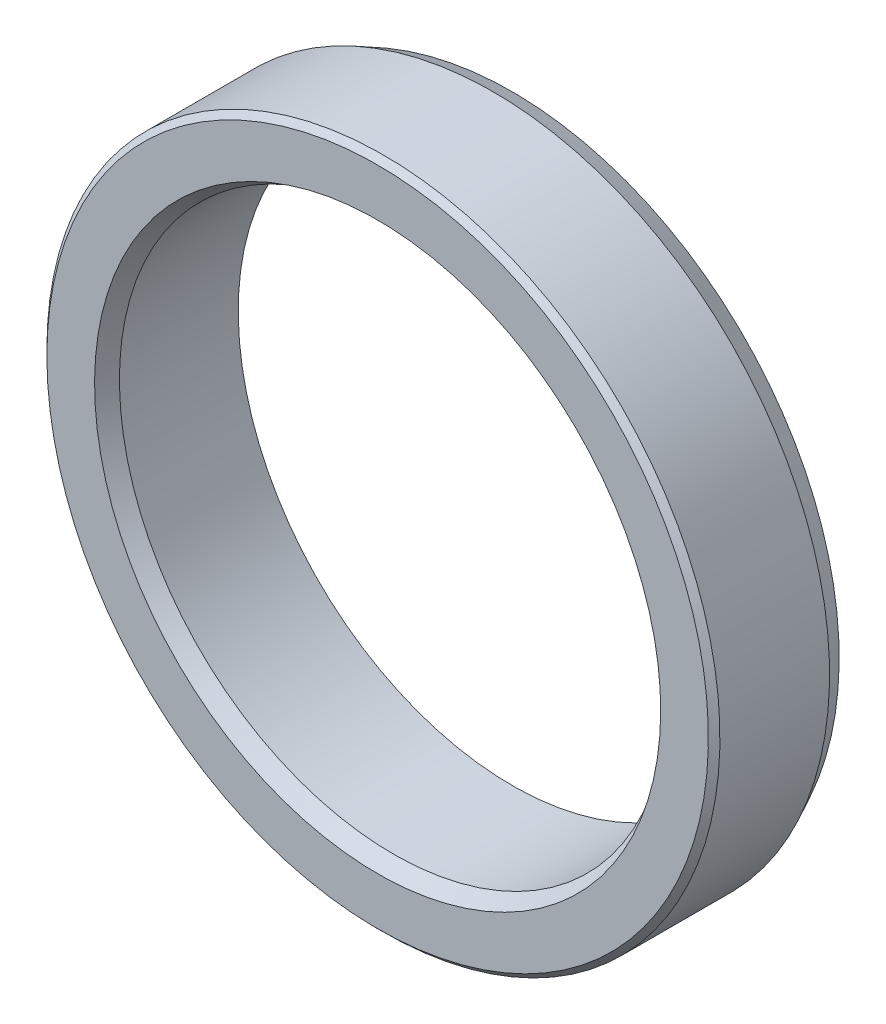
ISO-10303-21;
HEADER;
FILE_DESCRIPTION(('STEP AP214'),'2;1');
FILE_NAME('part.step','',(''),(''),'','','');
FILE_SCHEMA(('AUTOMOTIVE_DESIGN { 1 0 10303 214 1 1 1 1 }'));
ENDSEC;
DATA;
#1=APPLICATION_CONTEXT('core data for automotive mechanical design processes');
#2=APPLICATION_PROTOCOL_DEFINITION('international standard','automotive_design',2000,#1);
#3=PRODUCT_CONTEXT('',#1,'mechanical');
#4=PRODUCT('Part','Part','',(#3));
#5=PRODUCT_RELATED_PRODUCT_CATEGORY('part','',(#4));
#6=PRODUCT_DEFINITION_FORMATION('','',#4);
#7=PRODUCT_DEFINITION_CONTEXT('part definition',#1,'design');
#8=PRODUCT_DEFINITION('design','',#6,#7);
#9=PRODUCT_DEFINITION_SHAPE('','',#8);
#10=(LENGTH_UNIT() NAMED_UNIT(*) SI_UNIT(.MILLI.,.METRE.));
#11=(NAMED_UNIT(*) PLANE_ANGLE_UNIT() SI_UNIT($,.RADIAN.));
#12=(NAMED_UNIT(*) SI_UNIT($,.STERADIAN.) SOLID_ANGLE_UNIT());
#13=UNCERTAINTY_MEASURE_WITH_UNIT(LENGTH_MEASURE(1.E-05),#10,'distance_accuracy_value','');
#14=(GEOMETRIC_REPRESENTATION_CONTEXT(3) GLOBAL_UNCERTAINTY_ASSIGNED_CONTEXT((#13)) GLOBAL_UNIT_ASSIGNED_CONTEXT((#10,
#11,#12)) REPRESENTATION_CONTEXT('',''));
#15=CARTESIAN_POINT('',(0.,0.,0.));
#16=DIRECTION('',(0.,0.,1.));
#17=DIRECTION('',(1.,0.,0.));
#18=AXIS2_PLACEMENT_3D('',#15,#16,#17);
#19=CARTESIAN_POINT('',(0.,0.,-5.));
#20=DIRECTION('',(0.,0.,1.));
#21=DIRECTION('',(-0.383049008063239,0.923728021347068,0.));
#22=AXIS2_PLACEMENT_3D('',#19,#20,#21);
#23=CYLINDRICAL_SURFACE('',#22,17.5);
#24=CARTESIAN_POINT('',(0.,0.,1.7));
#25=DIRECTION('',(0.,0.,-1.));
#26=DIRECTION('',(0.383049008063239,-0.923728021347068,0.));
#27=AXIS2_PLACEMENT_3D('',#24,#25,#26);
#28=CIRCLE('',#27,17.5);
#29=CARTESIAN_POINT('',(6.70335764110665,-16.1652403735736,1.7));
#30=VERTEX_POINT('',#29);
#31=EDGE_CURVE('E11',#30,#30,#28,.T.);
#32=ORIENTED_EDGE('',*,*,#31,.T.);
#33=EDGE_LOOP('',(#32));
#34=FACE_BOUND('',#33,.T.);
#35=CARTESIAN_POINT('',(0.,0.,-4.));
#36=DIRECTION('',(0.,0.,1.));
#37=DIRECTION('',(0.383049008063239,-0.923728021347068,0.));
#38=AXIS2_PLACEMENT_3D('',#35,#36,#37);
#39=CIRCLE('',#38,17.5);
#40=CARTESIAN_POINT('',(6.70335764110665,-16.1652403735736,-4.));
#41=VERTEX_POINT('',#40);
#42=EDGE_CURVE('E28',#41,#41,#39,.T.);
#43=ORIENTED_EDGE('',*,*,#42,.T.);
#44=EDGE_LOOP('',(#43));
#45=FACE_BOUND('',#44,.T.);
#46=ADVANCED_FACE('F17',(#34,#45),#23,.T.);
#47=CARTESIAN_POINT('',(0.,0.,-5.));
#48=DIRECTION('',(0.,0.,1.));
#49=DIRECTION('',(-0.383049008063239,0.923728021347068,0.));
#50=AXIS2_PLACEMENT_3D('',#47,#48,#49);
#51=CYLINDRICAL_SURFACE('',#50,14.25);
#52=CARTESIAN_POINT('',(0.,0.,1.1775));
#53=DIRECTION('',(0.,0.,1.));
#54=DIRECTION('',(0.383049008063239,-0.923728021347068,0.));
#55=AXIS2_PLACEMENT_3D('',#52,#53,#54);
#56=CIRCLE('',#55,14.25);
#57=CARTESIAN_POINT('',(5.45844836490113,-13.1631243041957,1.1775));
#58=VERTEX_POINT('',#57);
#59=EDGE_CURVE('E60',#58,#58,#56,.T.);
#60=ORIENTED_EDGE('',*,*,#59,.T.);
#61=EDGE_LOOP('',(#60));
#62=FACE_BOUND('',#61,.T.);
#63=CARTESIAN_POINT('',(0.,0.,-5.));
#64=DIRECTION('',(0.,0.,1.));
#65=DIRECTION('',(0.383049008063239,-0.923728021347068,0.));
#66=AXIS2_PLACEMENT_3D('',#63,#64,#65);
#67=CIRCLE('',#66,14.25);
#68=CARTESIAN_POINT('',(5.45844836490113,-13.1631243041957,-5.));
#69=VERTEX_POINT('',#68);
#70=EDGE_CURVE('E21',#69,#69,#67,.T.);
#71=ORIENTED_EDGE('',*,*,#70,.F.);
#72=EDGE_LOOP('',(#71));
#73=FACE_BOUND('',#72,.T.);
#74=ADVANCED_FACE('F19',(#62,#73),#51,.F.);
#75=CARTESIAN_POINT('',(0.,0.,-5.));
#76=DIRECTION('',(0.,0.,1.));
#77=DIRECTION('',(-0.383049008063239,0.923728021347068,0.));
#78=AXIS2_PLACEMENT_3D('',#75,#76,#77);
#79=PLANE('',#78);
#80=CARTESIAN_POINT('',(0.,0.,-5.));
#81=DIRECTION('',(0.,0.,-1.));
#82=DIRECTION('',(0.383049008063239,-0.923728021347068,0.));
#83=AXIS2_PLACEMENT_3D('',#80,#81,#82);
#84=CIRCLE('',#83,17.);
#85=CARTESIAN_POINT('',(6.51183313707503,-15.7033763629001,-5.));
#86=VERTEX_POINT('',#85);
#87=EDGE_CURVE('E63',#86,#86,#84,.T.);
#88=ORIENTED_EDGE('',*,*,#87,.T.);
#89=EDGE_LOOP('',(#88));
#90=FACE_BOUND('',#89,.T.);
#91=ORIENTED_EDGE('',*,*,#70,.T.);
#92=EDGE_LOOP('',(#91));
#93=FACE_BOUND('',#92,.T.);
#94=ADVANCED_FACE('F78',(#90,#93),#79,.F.);
#95=CARTESIAN_POINT('',(0.,0.,2.));
#96=DIRECTION('',(0.,0.,1.));
#97=DIRECTION('',(-0.383049008063239,0.923728021347068,0.));
#98=AXIS2_PLACEMENT_3D('',#95,#96,#97);
#99=PLANE('',#98);
#100=CARTESIAN_POINT('',(0.,0.,2.));
#101=DIRECTION('',(0.,0.,1.));
#102=DIRECTION('',(0.383049008063239,-0.923728021347068,0.));
#103=AXIS2_PLACEMENT_3D('',#100,#101,#102);
#104=CIRCLE('',#103,17.2);
#105=CARTESIAN_POINT('',(6.58844293868768,-15.8881219671696,2.));
#106=VERTEX_POINT('',#105);
#107=EDGE_CURVE('E43',#106,#106,#104,.T.);
#108=ORIENTED_EDGE('',*,*,#107,.T.);
#109=EDGE_LOOP('',(#108));
#110=FACE_BOUND('',#109,.T.);
#111=CARTESIAN_POINT('',(0.,0.,2.));
#112=DIRECTION('',(0.,0.,-1.));
#113=DIRECTION('',(0.383049008063239,-0.923728021347068,0.));
#114=AXIS2_PLACEMENT_3D('',#111,#112,#113);
#115=CIRCLE('',#114,14.72);
#116=CARTESIAN_POINT('',(5.63848139869085,-13.5972764742288,2.));
#117=VERTEX_POINT('',#116);
#118=EDGE_CURVE('E47',#117,#117,#115,.T.);
#119=ORIENTED_EDGE('',*,*,#118,.T.);
#120=EDGE_LOOP('',(#119));
#121=FACE_BOUND('',#120,.T.);
#122=ADVANCED_FACE('F86',(#110,#121),#99,.T.);
#123=CARTESIAN_POINT('',(0.,0.,-5.));
#124=DIRECTION('',(0.,0.,1.));
#125=DIRECTION('',(-0.383049008063239,0.923728021347068,0.));
#126=AXIS2_PLACEMENT_3D('',#123,#124,#125);
#127=CONICAL_SURFACE('',#126,17.,0.463647609000806);
#128=ORIENTED_EDGE('',*,*,#87,.F.);
#129=EDGE_LOOP('',(#128));
#130=FACE_BOUND('',#129,.T.);
#131=ORIENTED_EDGE('',*,*,#42,.F.);
#132=EDGE_LOOP('',(#131));
#133=FACE_BOUND('',#132,.T.);
#134=ADVANCED_FACE('F96',(#130,#133),#127,.T.);
#135=CARTESIAN_POINT('',(0.,0.,2.));
#136=DIRECTION('',(0.,0.,1.));
#137=DIRECTION('',(-0.383049008063239,0.923728021347068,0.));
#138=AXIS2_PLACEMENT_3D('',#135,#136,#137);
#139=CONICAL_SURFACE('',#138,14.72,0.519146114246523);
#140=ORIENTED_EDGE('',*,*,#118,.F.);
#141=EDGE_LOOP('',(#140));
#142=FACE_BOUND('',#141,.T.);
#143=ORIENTED_EDGE('',*,*,#59,.F.);
#144=EDGE_LOOP('',(#143));
#145=FACE_BOUND('',#144,.T.);
#146=ADVANCED_FACE('F48',(#142,#145),#139,.F.);
#147=CARTESIAN_POINT('',(0.,0.,2.));
#148=DIRECTION('',(0.,0.,-1.));
#149=DIRECTION('',(0.383049008063239,-0.923728021347068,0.));
#150=AXIS2_PLACEMENT_3D('',#147,#148,#149);
#151=CONICAL_SURFACE('',#150,17.2,0.785398163397452);
#152=ORIENTED_EDGE('',*,*,#31,.F.);
#153=EDGE_LOOP('',(#152));
#154=FACE_BOUND('',#153,.T.);
#155=ORIENTED_EDGE('',*,*,#107,.F.);
#156=EDGE_LOOP('',(#155));
#157=FACE_BOUND('',#156,.T.);
#158=ADVANCED_FACE('F102',(#154,#157),#151,.T.);
#159=CLOSED_SHELL('',(#46,#74,#94,#122,#134,#146,#158));
#160=MANIFOLD_SOLID_BREP('B1',#159);
#161=ADVANCED_BREP_SHAPE_REPRESENTATION('',(#18,#160),#14);
#162=SHAPE_DEFINITION_REPRESENTATION(#9,#161);
ENDSEC;
END-ISO-10303-21;
